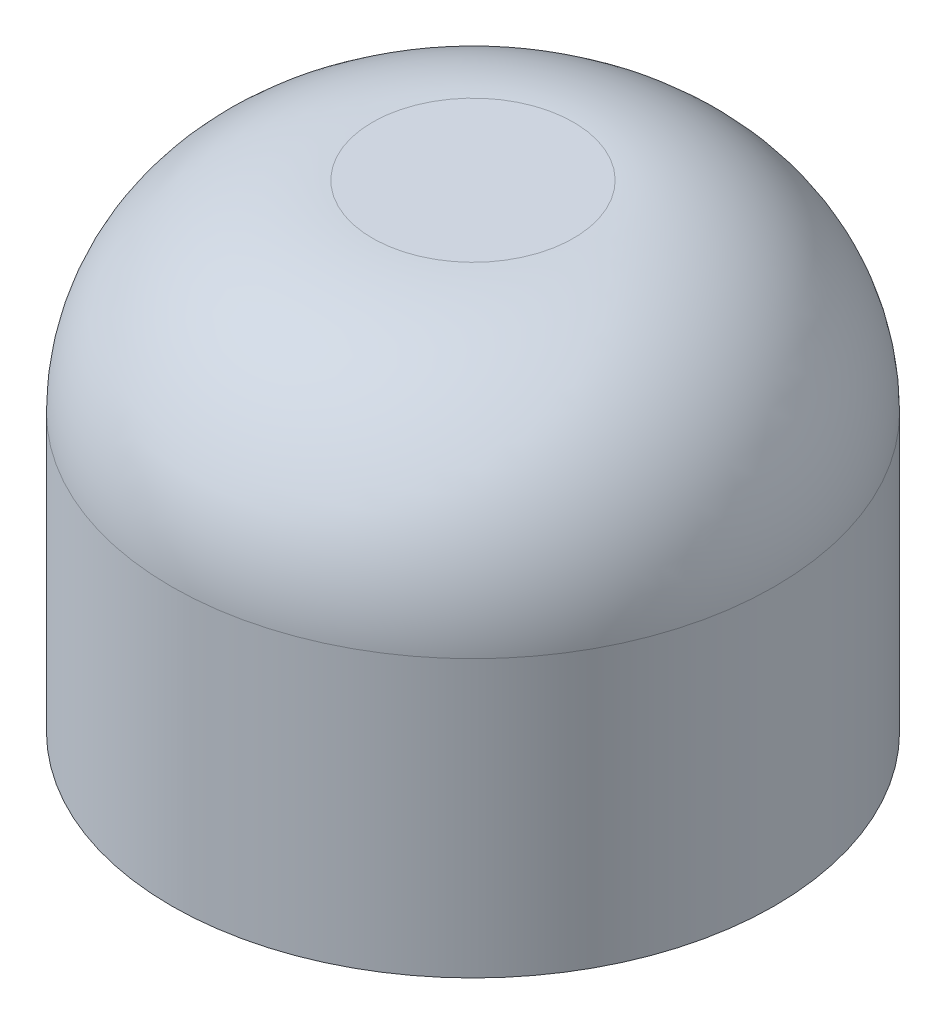
ISO-10303-21;
HEADER;
FILE_DESCRIPTION(('STEP AP214'),'2;1');
FILE_NAME('part.step','',(''),(''),'','','');
FILE_SCHEMA(('AUTOMOTIVE_DESIGN { 1 0 10303 214 1 1 1 1 }'));
ENDSEC;
DATA;
#1=APPLICATION_CONTEXT('core data for automotive mechanical design processes');
#2=APPLICATION_PROTOCOL_DEFINITION('international standard','automotive_design',2000,#1);
#3=PRODUCT_CONTEXT('',#1,'mechanical');
#4=PRODUCT('Part','Part','',(#3));
#5=PRODUCT_RELATED_PRODUCT_CATEGORY('part','',(#4));
#6=PRODUCT_DEFINITION_FORMATION('','',#4);
#7=PRODUCT_DEFINITION_CONTEXT('part definition',#1,'design');
#8=PRODUCT_DEFINITION('design','',#6,#7);
#9=PRODUCT_DEFINITION_SHAPE('','',#8);
#10=(LENGTH_UNIT() NAMED_UNIT(*) SI_UNIT(.MILLI.,.METRE.));
#11=(NAMED_UNIT(*) PLANE_ANGLE_UNIT() SI_UNIT($,.RADIAN.));
#12=(NAMED_UNIT(*) SI_UNIT($,.STERADIAN.) SOLID_ANGLE_UNIT());
#13=UNCERTAINTY_MEASURE_WITH_UNIT(LENGTH_MEASURE(1.E-05),#10,'distance_accuracy_value','');
#14=(GEOMETRIC_REPRESENTATION_CONTEXT(3) GLOBAL_UNCERTAINTY_ASSIGNED_CONTEXT((#13)) GLOBAL_UNIT_ASSIGNED_CONTEXT((#10,
#11,#12)) REPRESENTATION_CONTEXT('',''));
#15=CARTESIAN_POINT('',(0.,0.,0.));
#16=DIRECTION('',(0.,0.,1.));
#17=DIRECTION('',(1.,0.,0.));
#18=AXIS2_PLACEMENT_3D('',#15,#16,#17);
#19=CARTESIAN_POINT('',(0.,0.,0.));
#20=DIRECTION('',(0.,1.,0.));
#21=DIRECTION('',(-1.,0.,0.));
#22=AXIS2_PLACEMENT_3D('',#19,#20,#21);
#23=PLANE('',#22);
#24=CARTESIAN_POINT('',(0.,0.,0.));
#25=DIRECTION('',(0.,1.,0.));
#26=DIRECTION('',(-1.,0.,0.));
#27=AXIS2_PLACEMENT_3D('',#24,#25,#26);
#28=CIRCLE('',#27,1.5);
#29=CARTESIAN_POINT('',(-1.5,0.,0.));
#30=VERTEX_POINT('',#29);
#31=EDGE_CURVE('E10',#30,#30,#28,.T.);
#32=ORIENTED_EDGE('',*,*,#31,.F.);
#33=EDGE_LOOP('',(#32));
#34=FACE_BOUND('',#33,.T.);
#35=ADVANCED_FACE('F33',(#34),#23,.F.);
#36=CARTESIAN_POINT('',(0.,1.75,0.));
#37=DIRECTION('',(0.,1.,0.));
#38=DIRECTION('',(-1.,0.,0.));
#39=AXIS2_PLACEMENT_3D('',#36,#37,#38);
#40=CYLINDRICAL_SURFACE('',#39,1.5);
#41=CARTESIAN_POINT('',(0.,-3.,0.));
#42=DIRECTION('',(0.,1.,0.));
#43=DIRECTION('',(-1.,0.,0.));
#44=AXIS2_PLACEMENT_3D('',#41,#42,#43);
#45=CIRCLE('',#44,1.5);
#46=CARTESIAN_POINT('',(-1.5,-3.,0.));
#47=VERTEX_POINT('',#46);
#48=EDGE_CURVE('E39',#47,#47,#45,.T.);
#49=ORIENTED_EDGE('',*,*,#48,.F.);
#50=EDGE_LOOP('',(#49));
#51=FACE_BOUND('',#50,.T.);
#52=ORIENTED_EDGE('',*,*,#31,.T.);
#53=EDGE_LOOP('',(#52));
#54=FACE_BOUND('',#53,.T.);
#55=ADVANCED_FACE('F72',(#51,#54),#40,.F.);
#56=CARTESIAN_POINT('',(1.5,-3.,0.));
#57=DIRECTION('',(0.,1.,0.));
#58=DIRECTION('',(-1.,0.,0.));
#59=AXIS2_PLACEMENT_3D('',#56,#57,#58);
#60=PLANE('',#59);
#61=CARTESIAN_POINT('',(0.,-3.,0.));
#62=DIRECTION('',(0.,1.,0.));
#63=DIRECTION('',(-1.,0.,0.));
#64=AXIS2_PLACEMENT_3D('',#61,#62,#63);
#65=CIRCLE('',#64,3.);
#66=CARTESIAN_POINT('',(-3.,-3.,0.));
#67=VERTEX_POINT('',#66);
#68=EDGE_CURVE('E43',#67,#67,#65,.T.);
#69=ORIENTED_EDGE('',*,*,#68,.F.);
#70=EDGE_LOOP('',(#69));
#71=FACE_BOUND('',#70,.T.);
#72=ORIENTED_EDGE('',*,*,#48,.T.);
#73=EDGE_LOOP('',(#72));
#74=FACE_BOUND('',#73,.T.);
#75=ADVANCED_FACE('F67',(#71,#74),#60,.F.);
#76=CARTESIAN_POINT('',(0.,1.75,0.));
#77=DIRECTION('',(0.,1.,0.));
#78=DIRECTION('',(-1.,0.,0.));
#79=AXIS2_PLACEMENT_3D('',#76,#77,#78);
#80=CYLINDRICAL_SURFACE('',#79,3.);
#81=CARTESIAN_POINT('',(0.,-0.25,0.));
#82=DIRECTION('',(0.,1.,0.));
#83=DIRECTION('',(-1.,0.,0.));
#84=AXIS2_PLACEMENT_3D('',#81,#82,#83);
#85=CIRCLE('',#84,3.);
#86=CARTESIAN_POINT('',(-3.,-0.25,0.));
#87=VERTEX_POINT('',#86);
#88=EDGE_CURVE('E47',#87,#87,#85,.T.);
#89=ORIENTED_EDGE('',*,*,#88,.F.);
#90=EDGE_LOOP('',(#89));
#91=FACE_BOUND('',#90,.T.);
#92=ORIENTED_EDGE('',*,*,#68,.T.);
#93=EDGE_LOOP('',(#92));
#94=FACE_BOUND('',#93,.T.);
#95=ADVANCED_FACE('F61',(#91,#94),#80,.T.);
#96=CARTESIAN_POINT('',(0.,-0.25,0.));
#97=DIRECTION('',(0.,1.,0.));
#98=DIRECTION('',(-1.,0.,0.));
#99=AXIS2_PLACEMENT_3D('',#96,#97,#98);
#100=DEGENERATE_TOROIDAL_SURFACE('',#99,1.,2.,.T.);
#101=CARTESIAN_POINT('',(0.,1.75,0.));
#102=DIRECTION('',(0.,1.,0.));
#103=DIRECTION('',(-1.,0.,0.));
#104=AXIS2_PLACEMENT_3D('',#101,#102,#103);
#105=CIRCLE('',#104,1.);
#106=CARTESIAN_POINT('',(-1.,1.75,0.));
#107=VERTEX_POINT('',#106);
#108=EDGE_CURVE('E52',#107,#107,#105,.T.);
#109=ORIENTED_EDGE('',*,*,#108,.F.);
#110=EDGE_LOOP('',(#109));
#111=FACE_BOUND('',#110,.T.);
#112=ORIENTED_EDGE('',*,*,#88,.T.);
#113=EDGE_LOOP('',(#112));
#114=FACE_BOUND('',#113,.T.);
#115=ADVANCED_FACE('F58',(#111,#114),#100,.T.);
#116=CARTESIAN_POINT('',(1.,1.75,0.));
#117=DIRECTION('',(0.,-1.,0.));
#118=DIRECTION('',(1.,0.,0.));
#119=AXIS2_PLACEMENT_3D('',#116,#117,#118);
#120=PLANE('',#119);
#121=ORIENTED_EDGE('',*,*,#108,.T.);
#122=EDGE_LOOP('',(#121));
#123=FACE_BOUND('',#122,.T.);
#124=ADVANCED_FACE('F56',(#123),#120,.F.);
#125=CLOSED_SHELL('',(#35,#55,#75,#95,#115,#124));
#126=MANIFOLD_SOLID_BREP('B2',#125);
#127=ADVANCED_BREP_SHAPE_REPRESENTATION('',(#18,#126),#14);
#128=SHAPE_DEFINITION_REPRESENTATION(#9,#127);
ENDSEC;
END-ISO-10303-21;
